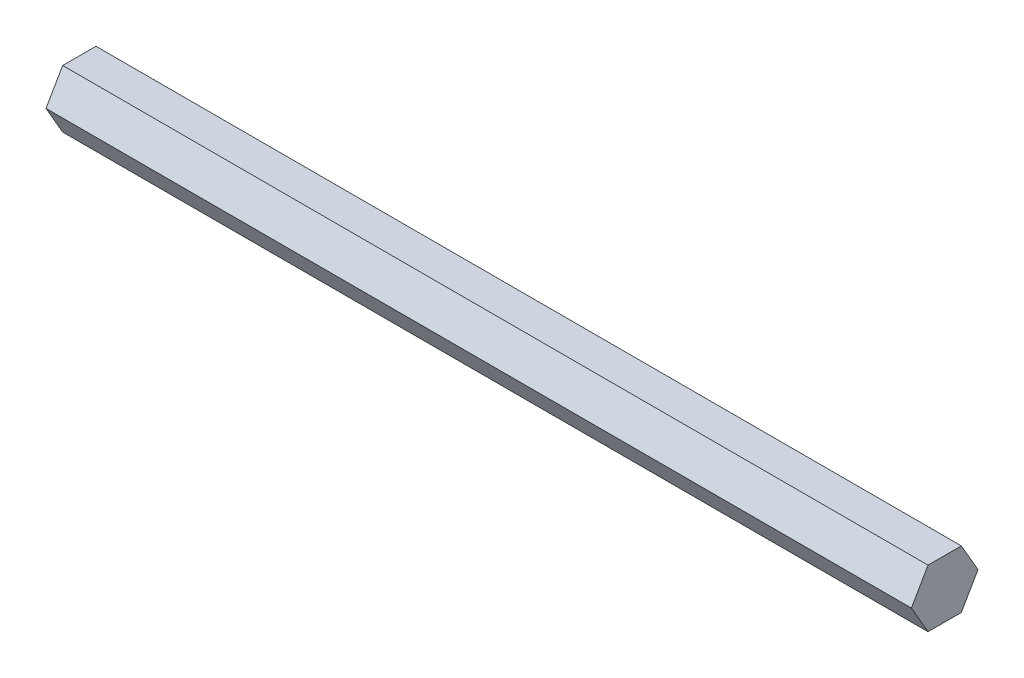
ISO-10303-21;
HEADER;
FILE_DESCRIPTION(('STEP AP214'),'2;1');
FILE_NAME('part.step','',(''),(''),'','','');
FILE_SCHEMA(('AUTOMOTIVE_DESIGN { 1 0 10303 214 1 1 1 1 }'));
ENDSEC;
DATA;
#1=APPLICATION_CONTEXT('core data for automotive mechanical design processes');
#2=APPLICATION_PROTOCOL_DEFINITION('international standard','automotive_design',2000,#1);
#3=PRODUCT_CONTEXT('',#1,'mechanical');
#4=PRODUCT('Part','Part','',(#3));
#5=PRODUCT_RELATED_PRODUCT_CATEGORY('part','',(#4));
#6=PRODUCT_DEFINITION_FORMATION('','',#4);
#7=PRODUCT_DEFINITION_CONTEXT('part definition',#1,'design');
#8=PRODUCT_DEFINITION('design','',#6,#7);
#9=PRODUCT_DEFINITION_SHAPE('','',#8);
#10=(LENGTH_UNIT() NAMED_UNIT(*) SI_UNIT(.MILLI.,.METRE.));
#11=(NAMED_UNIT(*) PLANE_ANGLE_UNIT() SI_UNIT($,.RADIAN.));
#12=(NAMED_UNIT(*) SI_UNIT($,.STERADIAN.) SOLID_ANGLE_UNIT());
#13=UNCERTAINTY_MEASURE_WITH_UNIT(LENGTH_MEASURE(1.E-05),#10,'distance_accuracy_value','');
#14=(GEOMETRIC_REPRESENTATION_CONTEXT(3) GLOBAL_UNCERTAINTY_ASSIGNED_CONTEXT((#13)) GLOBAL_UNIT_ASSIGNED_CONTEXT((#10,
#11,#12)) REPRESENTATION_CONTEXT('',''));
#15=CARTESIAN_POINT('',(0.,0.,0.));
#16=DIRECTION('',(0.,0.,1.));
#17=DIRECTION('',(1.,0.,0.));
#18=AXIS2_PLACEMENT_3D('',#15,#16,#17);
#19=CARTESIAN_POINT('',(190.5,-6.35000000000002,0.));
#20=DIRECTION('',(0.,1.,0.));
#21=DIRECTION('',(0.,0.,1.));
#22=AXIS2_PLACEMENT_3D('',#19,#20,#21);
#23=PLANE('',#22);
#24=DIRECTION('',(0.,0.,-1.));
#25=VECTOR('',#24,1.);
#26=CARTESIAN_POINT('',(0.,-6.35000000000002,0.));
#27=LINE('',#26,#25);
#28=CARTESIAN_POINT('',(0.,-6.35000000000002,3.6661742093541));
#29=VERTEX_POINT('',#28);
#30=CARTESIAN_POINT('',(0.,-6.35000000000003,-3.66617420935412));
#31=VERTEX_POINT('',#30);
#32=EDGE_CURVE('E122',#29,#31,#27,.T.);
#33=ORIENTED_EDGE('',*,*,#32,.T.);
#34=DIRECTION('',(-1.,0.,0.));
#35=VECTOR('',#34,1.);
#36=CARTESIAN_POINT('',(190.5,-6.35000000000003,-3.66617420935412));
#37=LINE('',#36,#35);
#38=CARTESIAN_POINT('',(190.5,-6.35000000000003,-3.66617420935412));
#39=VERTEX_POINT('',#38);
#40=EDGE_CURVE('E11',#39,#31,#37,.T.);
#41=ORIENTED_EDGE('',*,*,#40,.F.);
#42=DIRECTION('',(0.,0.,-1.));
#43=VECTOR('',#42,1.);
#44=CARTESIAN_POINT('',(190.5,-6.35000000000002,0.));
#45=LINE('',#44,#43);
#46=CARTESIAN_POINT('',(190.5,-6.35000000000002,3.6661742093541));
#47=VERTEX_POINT('',#46);
#48=EDGE_CURVE('E132',#47,#39,#45,.T.);
#49=ORIENTED_EDGE('',*,*,#48,.F.);
#50=DIRECTION('',(-1.,0.,0.));
#51=VECTOR('',#50,1.);
#52=CARTESIAN_POINT('',(190.5,-6.35000000000002,3.6661742093541));
#53=LINE('',#52,#51);
#54=EDGE_CURVE('E118',#47,#29,#53,.T.);
#55=ORIENTED_EDGE('',*,*,#54,.T.);
#56=EDGE_LOOP('',(#33,#41,#49,#55));
#57=FACE_BOUND('',#56,.T.);
#58=ADVANCED_FACE('F38',(#57),#23,.F.);
#59=CARTESIAN_POINT('',(190.5,-3.175,-5.49926131403119));
#60=DIRECTION('',(0.,0.5,0.866025403784439));
#61=DIRECTION('',(0.,-0.866025403784439,0.5));
#62=AXIS2_PLACEMENT_3D('',#59,#60,#61);
#63=PLANE('',#62);
#64=DIRECTION('',(0.,0.866025403784439,-0.5));
#65=VECTOR('',#64,1.);
#66=CARTESIAN_POINT('',(0.,-3.175,-5.49926131403119));
#67=LINE('',#66,#65);
#68=CARTESIAN_POINT('',(0.,0.,-7.33234841870825));
#69=VERTEX_POINT('',#68);
#70=EDGE_CURVE('E125',#31,#69,#67,.T.);
#71=ORIENTED_EDGE('',*,*,#70,.T.);
#72=DIRECTION('',(-1.,0.,0.));
#73=VECTOR('',#72,1.);
#74=CARTESIAN_POINT('',(190.5,0.,-7.33234841870825));
#75=LINE('',#74,#73);
#76=CARTESIAN_POINT('',(190.5,0.,-7.33234841870825));
#77=VERTEX_POINT('',#76);
#78=EDGE_CURVE('E46',#77,#69,#75,.T.);
#79=ORIENTED_EDGE('',*,*,#78,.F.);
#80=DIRECTION('',(0.,0.866025403784439,-0.5));
#81=VECTOR('',#80,1.);
#82=CARTESIAN_POINT('',(190.5,-3.175,-5.49926131403119));
#83=LINE('',#82,#81);
#84=EDGE_CURVE('E91',#39,#77,#83,.T.);
#85=ORIENTED_EDGE('',*,*,#84,.F.);
#86=ORIENTED_EDGE('',*,*,#40,.T.);
#87=EDGE_LOOP('',(#71,#79,#85,#86));
#88=FACE_BOUND('',#87,.T.);
#89=ADVANCED_FACE('F156',(#88),#63,.F.);
#90=CARTESIAN_POINT('',(190.5,3.175,-5.49926131403119));
#91=DIRECTION('',(0.,-0.5,0.866025403784439));
#92=DIRECTION('',(0.,-0.866025403784439,-0.5));
#93=AXIS2_PLACEMENT_3D('',#90,#91,#92);
#94=PLANE('',#93);
#95=DIRECTION('',(0.,0.866025403784439,0.5));
#96=VECTOR('',#95,1.);
#97=CARTESIAN_POINT('',(0.,3.175,-5.49926131403119));
#98=LINE('',#97,#96);
#99=CARTESIAN_POINT('',(0.,6.35,-3.66617420935413));
#100=VERTEX_POINT('',#99);
#101=EDGE_CURVE('E127',#69,#100,#98,.T.);
#102=ORIENTED_EDGE('',*,*,#101,.T.);
#103=DIRECTION('',(-1.,0.,0.));
#104=VECTOR('',#103,1.);
#105=CARTESIAN_POINT('',(190.5,6.35,-3.66617420935413));
#106=LINE('',#105,#104);
#107=CARTESIAN_POINT('',(190.5,6.35,-3.66617420935413));
#108=VERTEX_POINT('',#107);
#109=EDGE_CURVE('E113',#108,#100,#106,.T.);
#110=ORIENTED_EDGE('',*,*,#109,.F.);
#111=DIRECTION('',(0.,0.866025403784439,0.5));
#112=VECTOR('',#111,1.);
#113=CARTESIAN_POINT('',(190.5,3.175,-5.49926131403119));
#114=LINE('',#113,#112);
#115=EDGE_CURVE('E104',#77,#108,#114,.T.);
#116=ORIENTED_EDGE('',*,*,#115,.F.);
#117=ORIENTED_EDGE('',*,*,#78,.T.);
#118=EDGE_LOOP('',(#102,#110,#116,#117));
#119=FACE_BOUND('',#118,.T.);
#120=ADVANCED_FACE('F138',(#119),#94,.F.);
#121=CARTESIAN_POINT('',(190.5,6.35,0.));
#122=DIRECTION('',(0.,-1.,0.));
#123=DIRECTION('',(0.,0.,-1.));
#124=AXIS2_PLACEMENT_3D('',#121,#122,#123);
#125=PLANE('',#124);
#126=DIRECTION('',(0.,0.,1.));
#127=VECTOR('',#126,1.);
#128=CARTESIAN_POINT('',(0.,6.35,0.));
#129=LINE('',#128,#127);
#130=CARTESIAN_POINT('',(0.,6.35,3.66617420935412));
#131=VERTEX_POINT('',#130);
#132=EDGE_CURVE('E112',#100,#131,#129,.T.);
#133=ORIENTED_EDGE('',*,*,#132,.T.);
#134=DIRECTION('',(-1.,0.,0.));
#135=VECTOR('',#134,1.);
#136=CARTESIAN_POINT('',(190.5,6.35,3.66617420935412));
#137=LINE('',#136,#135);
#138=CARTESIAN_POINT('',(190.5,6.35,3.66617420935412));
#139=VERTEX_POINT('',#138);
#140=EDGE_CURVE('E109',#139,#131,#137,.T.);
#141=ORIENTED_EDGE('',*,*,#140,.F.);
#142=DIRECTION('',(0.,0.,1.));
#143=VECTOR('',#142,1.);
#144=CARTESIAN_POINT('',(190.5,6.35,0.));
#145=LINE('',#144,#143);
#146=EDGE_CURVE('E98',#108,#139,#145,.T.);
#147=ORIENTED_EDGE('',*,*,#146,.F.);
#148=ORIENTED_EDGE('',*,*,#109,.T.);
#149=EDGE_LOOP('',(#133,#141,#147,#148));
#150=FACE_BOUND('',#149,.T.);
#151=ADVANCED_FACE('F110',(#150),#125,.F.);
#152=CARTESIAN_POINT('',(190.5,3.175,5.49926131403118));
#153=DIRECTION('',(0.,-0.5,-0.866025403784439));
#154=DIRECTION('',(0.,0.866025403784439,-0.5));
#155=AXIS2_PLACEMENT_3D('',#152,#153,#154);
#156=PLANE('',#155);
#157=DIRECTION('',(0.,-0.866025403784439,0.5));
#158=VECTOR('',#157,1.);
#159=CARTESIAN_POINT('',(0.,3.175,5.49926131403118));
#160=LINE('',#159,#158);
#161=CARTESIAN_POINT('',(0.,0.,7.33234841870824));
#162=VERTEX_POINT('',#161);
#163=EDGE_CURVE('E77',#131,#162,#160,.T.);
#164=ORIENTED_EDGE('',*,*,#163,.T.);
#165=DIRECTION('',(-1.,0.,0.));
#166=VECTOR('',#165,1.);
#167=CARTESIAN_POINT('',(190.5,0.,7.33234841870824));
#168=LINE('',#167,#166);
#169=CARTESIAN_POINT('',(190.5,0.,7.33234841870824));
#170=VERTEX_POINT('',#169);
#171=EDGE_CURVE('E114',#170,#162,#168,.T.);
#172=ORIENTED_EDGE('',*,*,#171,.F.);
#173=DIRECTION('',(0.,-0.866025403784439,0.5));
#174=VECTOR('',#173,1.);
#175=CARTESIAN_POINT('',(190.5,3.175,5.49926131403118));
#176=LINE('',#175,#174);
#177=EDGE_CURVE('E102',#139,#170,#176,.T.);
#178=ORIENTED_EDGE('',*,*,#177,.F.);
#179=ORIENTED_EDGE('',*,*,#140,.T.);
#180=EDGE_LOOP('',(#164,#172,#178,#179));
#181=FACE_BOUND('',#180,.T.);
#182=ADVANCED_FACE('F116',(#181),#156,.F.);
#183=CARTESIAN_POINT('',(190.5,-3.17499999999999,5.49926131403118));
#184=DIRECTION('',(0.,0.5,-0.866025403784439));
#185=DIRECTION('',(0.,0.866025403784439,0.5));
#186=AXIS2_PLACEMENT_3D('',#183,#184,#185);
#187=PLANE('',#186);
#188=DIRECTION('',(0.,-0.866025403784439,-0.5));
#189=VECTOR('',#188,1.);
#190=CARTESIAN_POINT('',(0.,-3.17499999999999,5.49926131403118));
#191=LINE('',#190,#189);
#192=EDGE_CURVE('E83',#162,#29,#191,.T.);
#193=ORIENTED_EDGE('',*,*,#192,.T.);
#194=ORIENTED_EDGE('',*,*,#54,.F.);
#195=DIRECTION('',(0.,-0.866025403784439,-0.5));
#196=VECTOR('',#195,1.);
#197=CARTESIAN_POINT('',(190.5,-3.17499999999999,5.49926131403118));
#198=LINE('',#197,#196);
#199=EDGE_CURVE('E54',#170,#47,#198,.T.);
#200=ORIENTED_EDGE('',*,*,#199,.F.);
#201=ORIENTED_EDGE('',*,*,#171,.T.);
#202=EDGE_LOOP('',(#193,#194,#200,#201));
#203=FACE_BOUND('',#202,.T.);
#204=ADVANCED_FACE('F145',(#203),#187,.F.);
#205=CARTESIAN_POINT('',(190.5,0.,0.));
#206=DIRECTION('',(1.,0.,0.));
#207=DIRECTION('',(0.,0.,-1.));
#208=AXIS2_PLACEMENT_3D('',#205,#206,#207);
#209=PLANE('',#208);
#210=ORIENTED_EDGE('',*,*,#48,.T.);
#211=ORIENTED_EDGE('',*,*,#84,.T.);
#212=ORIENTED_EDGE('',*,*,#115,.T.);
#213=ORIENTED_EDGE('',*,*,#146,.T.);
#214=ORIENTED_EDGE('',*,*,#177,.T.);
#215=ORIENTED_EDGE('',*,*,#199,.T.);
#216=EDGE_LOOP('',(#210,#211,#212,#213,#214,#215));
#217=FACE_BOUND('',#216,.T.);
#218=ADVANCED_FACE('F100',(#217),#209,.T.);
#219=CARTESIAN_POINT('',(0.,0.,0.));
#220=DIRECTION('',(1.,0.,0.));
#221=DIRECTION('',(0.,0.,-1.));
#222=AXIS2_PLACEMENT_3D('',#219,#220,#221);
#223=PLANE('',#222);
#224=ORIENTED_EDGE('',*,*,#32,.F.);
#225=ORIENTED_EDGE('',*,*,#192,.F.);
#226=ORIENTED_EDGE('',*,*,#163,.F.);
#227=ORIENTED_EDGE('',*,*,#132,.F.);
#228=ORIENTED_EDGE('',*,*,#101,.F.);
#229=ORIENTED_EDGE('',*,*,#70,.F.);
#230=EDGE_LOOP('',(#224,#225,#226,#227,#228,#229));
#231=FACE_BOUND('',#230,.T.);
#232=ADVANCED_FACE('F141',(#231),#223,.F.);
#233=CLOSED_SHELL('',(#58,#89,#120,#151,#182,#204,#218,#232));
#234=MANIFOLD_SOLID_BREP('B2',#233);
#235=ADVANCED_BREP_SHAPE_REPRESENTATION('',(#18,#234),#14);
#236=SHAPE_DEFINITION_REPRESENTATION(#9,#235);
ENDSEC;
END-ISO-10303-21;
